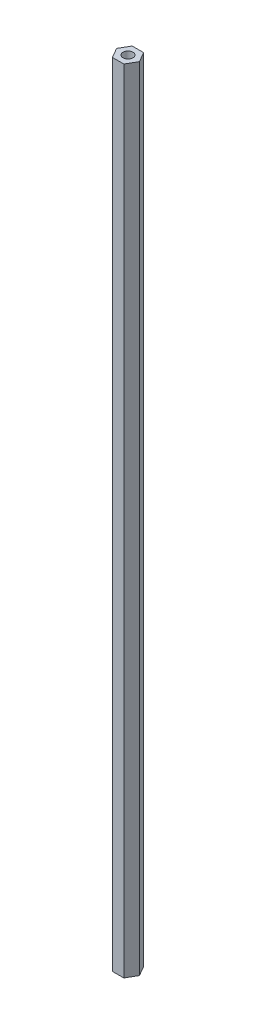
ISO-10303-21;
HEADER;
FILE_DESCRIPTION(('STEP AP214'),'2;1');
FILE_NAME('part.step','',(''),(''),'','','');
FILE_SCHEMA(('AUTOMOTIVE_DESIGN { 1 0 10303 214 1 1 1 1 }'));
ENDSEC;
DATA;
#1=APPLICATION_CONTEXT('core data for automotive mechanical design processes');
#2=APPLICATION_PROTOCOL_DEFINITION('international standard','automotive_design',2000,#1);
#3=PRODUCT_CONTEXT('',#1,'mechanical');
#4=PRODUCT('Part','Part','',(#3));
#5=PRODUCT_RELATED_PRODUCT_CATEGORY('part','',(#4));
#6=PRODUCT_DEFINITION_FORMATION('','',#4);
#7=PRODUCT_DEFINITION_CONTEXT('part definition',#1,'design');
#8=PRODUCT_DEFINITION('design','',#6,#7);
#9=PRODUCT_DEFINITION_SHAPE('','',#8);
#10=(LENGTH_UNIT() NAMED_UNIT(*) SI_UNIT(.MILLI.,.METRE.));
#11=(NAMED_UNIT(*) PLANE_ANGLE_UNIT() SI_UNIT($,.RADIAN.));
#12=(NAMED_UNIT(*) SI_UNIT($,.STERADIAN.) SOLID_ANGLE_UNIT());
#13=UNCERTAINTY_MEASURE_WITH_UNIT(LENGTH_MEASURE(1.E-05),#10,'distance_accuracy_value','');
#14=(GEOMETRIC_REPRESENTATION_CONTEXT(3) GLOBAL_UNCERTAINTY_ASSIGNED_CONTEXT((#13)) GLOBAL_UNIT_ASSIGNED_CONTEXT((#10,
#11,#12)) REPRESENTATION_CONTEXT('',''));
#15=CARTESIAN_POINT('',(0.,0.,0.));
#16=DIRECTION('',(0.,0.,1.));
#17=DIRECTION('',(1.,0.,0.));
#18=AXIS2_PLACEMENT_3D('',#15,#16,#17);
#19=CARTESIAN_POINT('',(0.,508.,0.));
#20=DIRECTION('',(0.,1.,0.));
#21=DIRECTION('',(0.,0.,1.));
#22=AXIS2_PLACEMENT_3D('',#19,#20,#21);
#23=PLANE('',#22);
#24=DIRECTION('',(1.,0.,0.));
#25=VECTOR('',#24,1.);
#26=CARTESIAN_POINT('',(-3.66617420935413,508.,6.35));
#27=LINE('',#26,#25);
#28=CARTESIAN_POINT('',(-3.66617420935413,508.,6.35));
#29=VERTEX_POINT('',#28);
#30=CARTESIAN_POINT('',(3.66617420935412,508.,6.35));
#31=VERTEX_POINT('',#30);
#32=EDGE_CURVE('E131',#29,#31,#27,.T.);
#33=ORIENTED_EDGE('',*,*,#32,.T.);
#34=DIRECTION('',(0.5,0.,-0.866025403784438));
#35=VECTOR('',#34,1.);
#36=CARTESIAN_POINT('',(3.66617420935412,508.,6.35));
#37=LINE('',#36,#35);
#38=CARTESIAN_POINT('',(7.33234841870825,508.,0.));
#39=VERTEX_POINT('',#38);
#40=EDGE_CURVE('E89',#31,#39,#37,.T.);
#41=ORIENTED_EDGE('',*,*,#40,.T.);
#42=DIRECTION('',(-0.5,0.,-0.866025403784439));
#43=VECTOR('',#42,1.);
#44=CARTESIAN_POINT('',(7.33234841870825,508.,0.));
#45=LINE('',#44,#43);
#46=CARTESIAN_POINT('',(3.66617420935413,508.,-6.35));
#47=VERTEX_POINT('',#46);
#48=EDGE_CURVE('E102',#39,#47,#45,.T.);
#49=ORIENTED_EDGE('',*,*,#48,.T.);
#50=DIRECTION('',(-1.,0.,0.));
#51=VECTOR('',#50,1.);
#52=CARTESIAN_POINT('',(3.66617420935413,508.,-6.35));
#53=LINE('',#52,#51);
#54=CARTESIAN_POINT('',(-3.66617420935412,508.,-6.35));
#55=VERTEX_POINT('',#54);
#56=EDGE_CURVE('E96',#47,#55,#53,.T.);
#57=ORIENTED_EDGE('',*,*,#56,.T.);
#58=DIRECTION('',(-0.5,0.,0.866025403784438));
#59=VECTOR('',#58,1.);
#60=CARTESIAN_POINT('',(-3.66617420935412,508.,-6.35));
#61=LINE('',#60,#59);
#62=CARTESIAN_POINT('',(-7.33234841870825,508.,0.));
#63=VERTEX_POINT('',#62);
#64=EDGE_CURVE('E100',#55,#63,#61,.T.);
#65=ORIENTED_EDGE('',*,*,#64,.T.);
#66=DIRECTION('',(0.5,0.,0.866025403784439));
#67=VECTOR('',#66,1.);
#68=CARTESIAN_POINT('',(-7.33234841870825,508.,0.));
#69=LINE('',#68,#67);
#70=EDGE_CURVE('E52',#63,#29,#69,.T.);
#71=ORIENTED_EDGE('',*,*,#70,.T.);
#72=EDGE_LOOP('',(#33,#41,#49,#57,#65,#71));
#73=FACE_BOUND('',#72,.T.);
#74=CARTESIAN_POINT('',(0.,508.,0.));
#75=DIRECTION('',(0.,1.,0.));
#76=DIRECTION('',(0.,0.,1.));
#77=AXIS2_PLACEMENT_3D('',#74,#75,#76);
#78=CIRCLE('',#77,3.175);
#79=CARTESIAN_POINT('',(0.,508.,3.175));
#80=VERTEX_POINT('',#79);
#81=EDGE_CURVE('E124',#80,#80,#78,.T.);
#82=ORIENTED_EDGE('',*,*,#81,.F.);
#83=EDGE_LOOP('',(#82));
#84=FACE_BOUND('',#83,.T.);
#85=ADVANCED_FACE('F35',(#73,#84),#23,.T.);
#86=CARTESIAN_POINT('',(0.,0.,0.));
#87=DIRECTION('',(0.,1.,0.));
#88=DIRECTION('',(0.,0.,1.));
#89=AXIS2_PLACEMENT_3D('',#86,#87,#88);
#90=PLANE('',#89);
#91=DIRECTION('',(1.,0.,0.));
#92=VECTOR('',#91,1.);
#93=CARTESIAN_POINT('',(-3.66617420935413,0.,6.35));
#94=LINE('',#93,#92);
#95=CARTESIAN_POINT('',(-3.66617420935413,0.,6.35));
#96=VERTEX_POINT('',#95);
#97=CARTESIAN_POINT('',(3.66617420935412,0.,6.35));
#98=VERTEX_POINT('',#97);
#99=EDGE_CURVE('E120',#96,#98,#94,.T.);
#100=ORIENTED_EDGE('',*,*,#99,.F.);
#101=DIRECTION('',(0.5,0.,0.866025403784439));
#102=VECTOR('',#101,1.);
#103=CARTESIAN_POINT('',(-7.33234841870825,0.,0.));
#104=LINE('',#103,#102);
#105=CARTESIAN_POINT('',(-7.33234841870825,0.,0.));
#106=VERTEX_POINT('',#105);
#107=EDGE_CURVE('E81',#106,#96,#104,.T.);
#108=ORIENTED_EDGE('',*,*,#107,.F.);
#109=DIRECTION('',(-0.5,0.,0.866025403784438));
#110=VECTOR('',#109,1.);
#111=CARTESIAN_POINT('',(-3.66617420935412,0.,-6.35));
#112=LINE('',#111,#110);
#113=CARTESIAN_POINT('',(-3.66617420935412,0.,-6.35));
#114=VERTEX_POINT('',#113);
#115=EDGE_CURVE('E75',#114,#106,#112,.T.);
#116=ORIENTED_EDGE('',*,*,#115,.F.);
#117=DIRECTION('',(-1.,0.,0.));
#118=VECTOR('',#117,1.);
#119=CARTESIAN_POINT('',(3.66617420935413,0.,-6.35));
#120=LINE('',#119,#118);
#121=CARTESIAN_POINT('',(3.66617420935413,0.,-6.35));
#122=VERTEX_POINT('',#121);
#123=EDGE_CURVE('E110',#122,#114,#120,.T.);
#124=ORIENTED_EDGE('',*,*,#123,.F.);
#125=DIRECTION('',(-0.5,0.,-0.866025403784439));
#126=VECTOR('',#125,1.);
#127=CARTESIAN_POINT('',(7.33234841870825,0.,0.));
#128=LINE('',#127,#126);
#129=CARTESIAN_POINT('',(7.33234841870825,0.,0.));
#130=VERTEX_POINT('',#129);
#131=EDGE_CURVE('E126',#130,#122,#128,.T.);
#132=ORIENTED_EDGE('',*,*,#131,.F.);
#133=DIRECTION('',(0.5,0.,-0.866025403784438));
#134=VECTOR('',#133,1.);
#135=CARTESIAN_POINT('',(3.66617420935412,0.,6.35));
#136=LINE('',#135,#134);
#137=EDGE_CURVE('E123',#98,#130,#136,.T.);
#138=ORIENTED_EDGE('',*,*,#137,.F.);
#139=EDGE_LOOP('',(#100,#108,#116,#124,#132,#138));
#140=FACE_BOUND('',#139,.T.);
#141=CARTESIAN_POINT('',(0.,0.,0.));
#142=DIRECTION('',(0.,1.,0.));
#143=DIRECTION('',(0.,0.,1.));
#144=AXIS2_PLACEMENT_3D('',#141,#142,#143);
#145=CIRCLE('',#144,3.175);
#146=CARTESIAN_POINT('',(0.,0.,3.175));
#147=VERTEX_POINT('',#146);
#148=EDGE_CURVE('E224',#147,#147,#145,.T.);
#149=ORIENTED_EDGE('',*,*,#148,.T.);
#150=EDGE_LOOP('',(#149));
#151=FACE_BOUND('',#150,.T.);
#152=ADVANCED_FACE('F140',(#140,#151),#90,.F.);
#153=CARTESIAN_POINT('',(-3.66617420935413,508.,6.35));
#154=DIRECTION('',(0.,0.,-1.));
#155=DIRECTION('',(-1.,0.,0.));
#156=AXIS2_PLACEMENT_3D('',#153,#154,#155);
#157=PLANE('',#156);
#158=ORIENTED_EDGE('',*,*,#99,.T.);
#159=DIRECTION('',(0.,-1.,0.));
#160=VECTOR('',#159,1.);
#161=CARTESIAN_POINT('',(3.66617420935412,508.,6.35));
#162=LINE('',#161,#160);
#163=EDGE_CURVE('E11',#31,#98,#162,.T.);
#164=ORIENTED_EDGE('',*,*,#163,.F.);
#165=ORIENTED_EDGE('',*,*,#32,.F.);
#166=DIRECTION('',(0.,-1.,0.));
#167=VECTOR('',#166,1.);
#168=CARTESIAN_POINT('',(-3.66617420935413,508.,6.35));
#169=LINE('',#168,#167);
#170=EDGE_CURVE('E116',#29,#96,#169,.T.);
#171=ORIENTED_EDGE('',*,*,#170,.T.);
#172=EDGE_LOOP('',(#158,#164,#165,#171));
#173=FACE_BOUND('',#172,.T.);
#174=ADVANCED_FACE('F37',(#173),#157,.F.);
#175=CARTESIAN_POINT('',(3.66617420935412,508.,6.35));
#176=DIRECTION('',(-0.866025403784438,0.,-0.5));
#177=DIRECTION('',(-0.5,0.,0.866025403784439));
#178=AXIS2_PLACEMENT_3D('',#175,#176,#177);
#179=PLANE('',#178);
#180=ORIENTED_EDGE('',*,*,#137,.T.);
#181=DIRECTION('',(0.,-1.,0.));
#182=VECTOR('',#181,1.);
#183=CARTESIAN_POINT('',(7.33234841870825,508.,0.));
#184=LINE('',#183,#182);
#185=EDGE_CURVE('E44',#39,#130,#184,.T.);
#186=ORIENTED_EDGE('',*,*,#185,.F.);
#187=ORIENTED_EDGE('',*,*,#40,.F.);
#188=ORIENTED_EDGE('',*,*,#163,.T.);
#189=EDGE_LOOP('',(#180,#186,#187,#188));
#190=FACE_BOUND('',#189,.T.);
#191=ADVANCED_FACE('F165',(#190),#179,.F.);
#192=CARTESIAN_POINT('',(7.33234841870825,508.,0.));
#193=DIRECTION('',(-0.866025403784439,0.,0.5));
#194=DIRECTION('',(0.5,0.,0.866025403784439));
#195=AXIS2_PLACEMENT_3D('',#192,#193,#194);
#196=PLANE('',#195);
#197=ORIENTED_EDGE('',*,*,#131,.T.);
#198=DIRECTION('',(0.,-1.,0.));
#199=VECTOR('',#198,1.);
#200=CARTESIAN_POINT('',(3.66617420935413,508.,-6.35));
#201=LINE('',#200,#199);
#202=EDGE_CURVE('E111',#47,#122,#201,.T.);
#203=ORIENTED_EDGE('',*,*,#202,.F.);
#204=ORIENTED_EDGE('',*,*,#48,.F.);
#205=ORIENTED_EDGE('',*,*,#185,.T.);
#206=EDGE_LOOP('',(#197,#203,#204,#205));
#207=FACE_BOUND('',#206,.T.);
#208=ADVANCED_FACE('F137',(#207),#196,.F.);
#209=CARTESIAN_POINT('',(3.66617420935413,508.,-6.35));
#210=DIRECTION('',(0.,0.,1.));
#211=DIRECTION('',(1.,0.,0.));
#212=AXIS2_PLACEMENT_3D('',#209,#210,#211);
#213=PLANE('',#212);
#214=ORIENTED_EDGE('',*,*,#123,.T.);
#215=DIRECTION('',(0.,-1.,0.));
#216=VECTOR('',#215,1.);
#217=CARTESIAN_POINT('',(-3.66617420935412,508.,-6.35));
#218=LINE('',#217,#216);
#219=EDGE_CURVE('E107',#55,#114,#218,.T.);
#220=ORIENTED_EDGE('',*,*,#219,.F.);
#221=ORIENTED_EDGE('',*,*,#56,.F.);
#222=ORIENTED_EDGE('',*,*,#202,.T.);
#223=EDGE_LOOP('',(#214,#220,#221,#222));
#224=FACE_BOUND('',#223,.T.);
#225=ADVANCED_FACE('F108',(#224),#213,.F.);
#226=CARTESIAN_POINT('',(-3.66617420935412,508.,-6.35));
#227=DIRECTION('',(0.866025403784438,0.,0.5));
#228=DIRECTION('',(0.5,0.,-0.866025403784439));
#229=AXIS2_PLACEMENT_3D('',#226,#227,#228);
#230=PLANE('',#229);
#231=ORIENTED_EDGE('',*,*,#115,.T.);
#232=DIRECTION('',(0.,-1.,0.));
#233=VECTOR('',#232,1.);
#234=CARTESIAN_POINT('',(-7.33234841870825,508.,0.));
#235=LINE('',#234,#233);
#236=EDGE_CURVE('E112',#63,#106,#235,.T.);
#237=ORIENTED_EDGE('',*,*,#236,.F.);
#238=ORIENTED_EDGE('',*,*,#64,.F.);
#239=ORIENTED_EDGE('',*,*,#219,.T.);
#240=EDGE_LOOP('',(#231,#237,#238,#239));
#241=FACE_BOUND('',#240,.T.);
#242=ADVANCED_FACE('F114',(#241),#230,.F.);
#243=CARTESIAN_POINT('',(-7.33234841870825,508.,0.));
#244=DIRECTION('',(0.866025403784439,0.,-0.5));
#245=DIRECTION('',(-0.5,0.,-0.866025403784439));
#246=AXIS2_PLACEMENT_3D('',#243,#244,#245);
#247=PLANE('',#246);
#248=ORIENTED_EDGE('',*,*,#107,.T.);
#249=ORIENTED_EDGE('',*,*,#170,.F.);
#250=ORIENTED_EDGE('',*,*,#70,.F.);
#251=ORIENTED_EDGE('',*,*,#236,.T.);
#252=EDGE_LOOP('',(#248,#249,#250,#251));
#253=FACE_BOUND('',#252,.T.);
#254=ADVANCED_FACE('F145',(#253),#247,.F.);
#255=CARTESIAN_POINT('',(0.,508.,0.));
#256=DIRECTION('',(0.,-1.,0.));
#257=DIRECTION('',(0.,0.,-1.));
#258=AXIS2_PLACEMENT_3D('',#255,#256,#257);
#259=CYLINDRICAL_SURFACE('',#258,3.175);
#260=ORIENTED_EDGE('',*,*,#81,.T.);
#261=EDGE_LOOP('',(#260));
#262=FACE_BOUND('',#261,.T.);
#263=ORIENTED_EDGE('',*,*,#148,.F.);
#264=EDGE_LOOP('',(#263));
#265=FACE_BOUND('',#264,.T.);
#266=ADVANCED_FACE('F147',(#262,#265),#259,.F.);
#267=CLOSED_SHELL('',(#85,#152,#174,#191,#208,#225,#242,#254,#266));
#268=MANIFOLD_SOLID_BREP('B2',#267);
#269=ADVANCED_BREP_SHAPE_REPRESENTATION('',(#18,#268),#14);
#270=SHAPE_DEFINITION_REPRESENTATION(#9,#269);
ENDSEC;
END-ISO-10303-21;
